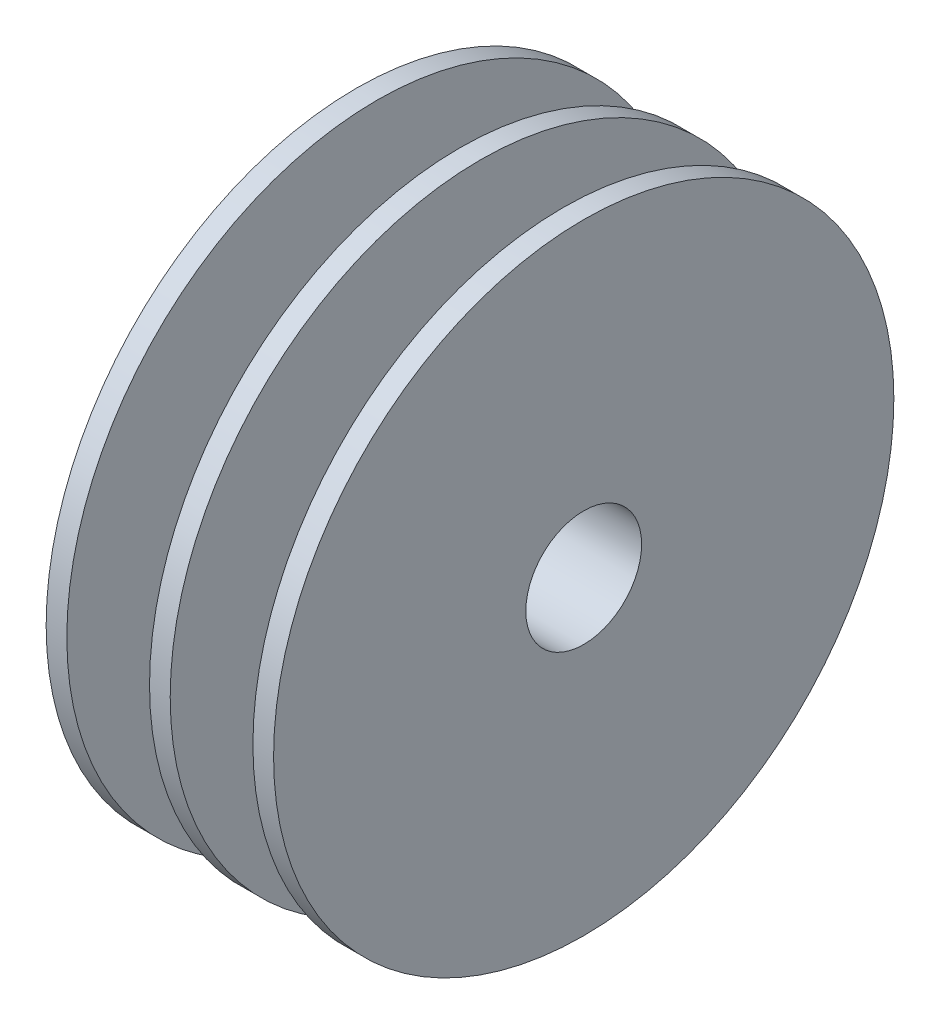
ISO-10303-21;
HEADER;
FILE_DESCRIPTION(('STEP AP214'),'2;1');
FILE_NAME('part.step','',(''),(''),'','','');
FILE_SCHEMA(('AUTOMOTIVE_DESIGN { 1 0 10303 214 1 1 1 1 }'));
ENDSEC;
DATA;
#1=APPLICATION_CONTEXT('core data for automotive mechanical design processes');
#2=APPLICATION_PROTOCOL_DEFINITION('international standard','automotive_design',2000,#1);
#3=PRODUCT_CONTEXT('',#1,'mechanical');
#4=PRODUCT('Part','Part','',(#3));
#5=PRODUCT_RELATED_PRODUCT_CATEGORY('part','',(#4));
#6=PRODUCT_DEFINITION_FORMATION('','',#4);
#7=PRODUCT_DEFINITION_CONTEXT('part definition',#1,'design');
#8=PRODUCT_DEFINITION('design','',#6,#7);
#9=PRODUCT_DEFINITION_SHAPE('','',#8);
#10=(LENGTH_UNIT() NAMED_UNIT(*) SI_UNIT(.MILLI.,.METRE.));
#11=(NAMED_UNIT(*) PLANE_ANGLE_UNIT() SI_UNIT($,.RADIAN.));
#12=(NAMED_UNIT(*) SI_UNIT($,.STERADIAN.) SOLID_ANGLE_UNIT());
#13=UNCERTAINTY_MEASURE_WITH_UNIT(LENGTH_MEASURE(1.E-05),#10,'distance_accuracy_value','');
#14=(GEOMETRIC_REPRESENTATION_CONTEXT(3) GLOBAL_UNCERTAINTY_ASSIGNED_CONTEXT((#13)) GLOBAL_UNIT_ASSIGNED_CONTEXT((#10,
#11,#12)) REPRESENTATION_CONTEXT('',''));
#15=CARTESIAN_POINT('',(0.,0.,0.));
#16=DIRECTION('',(0.,0.,1.));
#17=DIRECTION('',(1.,0.,0.));
#18=AXIS2_PLACEMENT_3D('',#15,#16,#17);
#19=CARTESIAN_POINT('',(1.,0.,0.));
#20=DIRECTION('',(-1.,0.,0.));
#21=DIRECTION('',(0.,0.,1.));
#22=AXIS2_PLACEMENT_3D('',#19,#20,#21);
#23=CYLINDRICAL_SURFACE('',#22,15.);
#24=CARTESIAN_POINT('',(1.,0.,0.));
#25=DIRECTION('',(1.,0.,0.));
#26=DIRECTION('',(0.,0.,-1.));
#27=AXIS2_PLACEMENT_3D('',#24,#25,#26);
#28=CIRCLE('',#27,15.);
#29=CARTESIAN_POINT('',(0.999999999999999,0.,-15.));
#30=VERTEX_POINT('',#29);
#31=EDGE_CURVE('E42',#30,#30,#28,.T.);
#32=ORIENTED_EDGE('',*,*,#31,.F.);
#33=EDGE_LOOP('',(#32));
#34=FACE_BOUND('',#33,.T.);
#35=CARTESIAN_POINT('',(0.,0.,0.));
#36=DIRECTION('',(1.,0.,0.));
#37=DIRECTION('',(0.,0.,-1.));
#38=AXIS2_PLACEMENT_3D('',#35,#36,#37);
#39=CIRCLE('',#38,15.);
#40=CARTESIAN_POINT('',(0.,0.,-15.));
#41=VERTEX_POINT('',#40);
#42=EDGE_CURVE('E56',#41,#41,#39,.T.);
#43=ORIENTED_EDGE('',*,*,#42,.T.);
#44=EDGE_LOOP('',(#43));
#45=FACE_BOUND('',#44,.T.);
#46=ADVANCED_FACE('F30',(#34,#45),#23,.T.);
#47=CARTESIAN_POINT('',(1.,0.,0.));
#48=DIRECTION('',(1.,0.,0.));
#49=DIRECTION('',(0.,0.,-1.));
#50=AXIS2_PLACEMENT_3D('',#47,#48,#49);
#51=PLANE('',#50);
#52=CARTESIAN_POINT('',(1.,0.,0.));
#53=DIRECTION('',(1.,0.,0.));
#54=DIRECTION('',(0.,0.,-1.));
#55=AXIS2_PLACEMENT_3D('',#52,#53,#54);
#56=CIRCLE('',#55,5.);
#57=CARTESIAN_POINT('',(1.,0.,-5.));
#58=VERTEX_POINT('',#57);
#59=EDGE_CURVE('E37',#58,#58,#56,.T.);
#60=ORIENTED_EDGE('',*,*,#59,.F.);
#61=EDGE_LOOP('',(#60));
#62=FACE_BOUND('',#61,.T.);
#63=ORIENTED_EDGE('',*,*,#31,.T.);
#64=EDGE_LOOP('',(#63));
#65=FACE_BOUND('',#64,.T.);
#66=ADVANCED_FACE('F66',(#62,#65),#51,.T.);
#67=CARTESIAN_POINT('',(0.,0.,0.));
#68=DIRECTION('',(1.,0.,0.));
#69=DIRECTION('',(0.,0.,-1.));
#70=AXIS2_PLACEMENT_3D('',#67,#68,#69);
#71=PLANE('',#70);
#72=CARTESIAN_POINT('',(0.,0.,0.));
#73=DIRECTION('',(-1.,0.,0.));
#74=DIRECTION('',(0.,0.,1.));
#75=AXIS2_PLACEMENT_3D('',#72,#73,#74);
#76=CIRCLE('',#75,2.375);
#77=CARTESIAN_POINT('',(0.,0.,2.375));
#78=VERTEX_POINT('',#77);
#79=EDGE_CURVE('E235',#78,#78,#76,.T.);
#80=ORIENTED_EDGE('',*,*,#79,.F.);
#81=EDGE_LOOP('',(#80));
#82=FACE_BOUND('',#81,.T.);
#83=ORIENTED_EDGE('',*,*,#42,.F.);
#84=EDGE_LOOP('',(#83));
#85=FACE_BOUND('',#84,.T.);
#86=ADVANCED_FACE('F63',(#82,#85),#71,.F.);
#87=CARTESIAN_POINT('',(5.,0.,0.));
#88=DIRECTION('',(-1.,0.,0.));
#89=DIRECTION('',(0.,0.,1.));
#90=AXIS2_PLACEMENT_3D('',#87,#88,#89);
#91=CYLINDRICAL_SURFACE('',#90,5.);
#92=CARTESIAN_POINT('',(5.,0.,0.));
#93=DIRECTION('',(1.,0.,0.));
#94=DIRECTION('',(0.,0.,-1.));
#95=AXIS2_PLACEMENT_3D('',#92,#93,#94);
#96=CIRCLE('',#95,5.);
#97=CARTESIAN_POINT('',(5.,0.,-5.));
#98=VERTEX_POINT('',#97);
#99=EDGE_CURVE('E51',#98,#98,#96,.T.);
#100=ORIENTED_EDGE('',*,*,#99,.F.);
#101=EDGE_LOOP('',(#100));
#102=FACE_BOUND('',#101,.T.);
#103=ORIENTED_EDGE('',*,*,#59,.T.);
#104=EDGE_LOOP('',(#103));
#105=FACE_BOUND('',#104,.T.);
#106=ADVANCED_FACE('F65',(#102,#105),#91,.T.);
#107=CARTESIAN_POINT('',(6.,0.,0.));
#108=DIRECTION('',(-1.,0.,0.));
#109=DIRECTION('',(0.,0.,1.));
#110=AXIS2_PLACEMENT_3D('',#107,#108,#109);
#111=CYLINDRICAL_SURFACE('',#110,15.);
#112=CARTESIAN_POINT('',(6.,0.,0.));
#113=DIRECTION('',(1.,0.,0.));
#114=DIRECTION('',(0.,0.,-1.));
#115=AXIS2_PLACEMENT_3D('',#112,#113,#114);
#116=CIRCLE('',#115,15.);
#117=CARTESIAN_POINT('',(6.,0.,-15.));
#118=VERTEX_POINT('',#117);
#119=EDGE_CURVE('E48',#118,#118,#116,.T.);
#120=ORIENTED_EDGE('',*,*,#119,.F.);
#121=EDGE_LOOP('',(#120));
#122=FACE_BOUND('',#121,.T.);
#123=CARTESIAN_POINT('',(5.,0.,0.));
#124=DIRECTION('',(1.,0.,0.));
#125=DIRECTION('',(0.,0.,-1.));
#126=AXIS2_PLACEMENT_3D('',#123,#124,#125);
#127=CIRCLE('',#126,15.);
#128=CARTESIAN_POINT('',(5.,0.,-15.));
#129=VERTEX_POINT('',#128);
#130=EDGE_CURVE('E52',#129,#129,#127,.T.);
#131=ORIENTED_EDGE('',*,*,#130,.T.);
#132=EDGE_LOOP('',(#131));
#133=FACE_BOUND('',#132,.T.);
#134=ADVANCED_FACE('F72',(#122,#133),#111,.T.);
#135=CARTESIAN_POINT('',(6.,0.,0.));
#136=DIRECTION('',(1.,0.,0.));
#137=DIRECTION('',(0.,0.,-1.));
#138=AXIS2_PLACEMENT_3D('',#135,#136,#137);
#139=PLANE('',#138);
#140=CARTESIAN_POINT('',(6.,0.,0.));
#141=DIRECTION('',(1.,0.,0.));
#142=DIRECTION('',(0.,0.,-1.));
#143=AXIS2_PLACEMENT_3D('',#140,#141,#142);
#144=CIRCLE('',#143,5.);
#145=CARTESIAN_POINT('',(6.,0.,-5.));
#146=VERTEX_POINT('',#145);
#147=EDGE_CURVE('E10',#146,#146,#144,.T.);
#148=ORIENTED_EDGE('',*,*,#147,.F.);
#149=EDGE_LOOP('',(#148));
#150=FACE_BOUND('',#149,.T.);
#151=ORIENTED_EDGE('',*,*,#119,.T.);
#152=EDGE_LOOP('',(#151));
#153=FACE_BOUND('',#152,.T.);
#154=ADVANCED_FACE('F104',(#150,#153),#139,.T.);
#155=CARTESIAN_POINT('',(5.,0.,0.));
#156=DIRECTION('',(1.,0.,0.));
#157=DIRECTION('',(0.,0.,-1.));
#158=AXIS2_PLACEMENT_3D('',#155,#156,#157);
#159=PLANE('',#158);
#160=ORIENTED_EDGE('',*,*,#99,.T.);
#161=EDGE_LOOP('',(#160));
#162=FACE_BOUND('',#161,.T.);
#163=ORIENTED_EDGE('',*,*,#130,.F.);
#164=EDGE_LOOP('',(#163));
#165=FACE_BOUND('',#164,.T.);
#166=ADVANCED_FACE('F112',(#162,#165),#159,.F.);
#167=CARTESIAN_POINT('',(10.,0.,0.));
#168=DIRECTION('',(-1.,0.,0.));
#169=DIRECTION('',(0.,0.,1.));
#170=AXIS2_PLACEMENT_3D('',#167,#168,#169);
#171=CYLINDRICAL_SURFACE('',#170,5.);
#172=CARTESIAN_POINT('',(10.,0.,0.));
#173=DIRECTION('',(1.,0.,0.));
#174=DIRECTION('',(0.,0.,-1.));
#175=AXIS2_PLACEMENT_3D('',#172,#173,#174);
#176=CIRCLE('',#175,5.);
#177=CARTESIAN_POINT('',(10.,0.,-5.));
#178=VERTEX_POINT('',#177);
#179=EDGE_CURVE('E46',#178,#178,#176,.T.);
#180=ORIENTED_EDGE('',*,*,#179,.F.);
#181=EDGE_LOOP('',(#180));
#182=FACE_BOUND('',#181,.T.);
#183=ORIENTED_EDGE('',*,*,#147,.T.);
#184=EDGE_LOOP('',(#183));
#185=FACE_BOUND('',#184,.T.);
#186=ADVANCED_FACE('F117',(#182,#185),#171,.T.);
#187=CARTESIAN_POINT('',(11.,0.,0.));
#188=DIRECTION('',(-1.,0.,0.));
#189=DIRECTION('',(0.,0.,1.));
#190=AXIS2_PLACEMENT_3D('',#187,#188,#189);
#191=CYLINDRICAL_SURFACE('',#190,15.);
#192=CARTESIAN_POINT('',(11.,0.,0.));
#193=DIRECTION('',(1.,0.,0.));
#194=DIRECTION('',(0.,0.,-1.));
#195=AXIS2_PLACEMENT_3D('',#192,#193,#194);
#196=CIRCLE('',#195,15.);
#197=CARTESIAN_POINT('',(11.,0.,-15.));
#198=VERTEX_POINT('',#197);
#199=EDGE_CURVE('E242',#198,#198,#196,.T.);
#200=ORIENTED_EDGE('',*,*,#199,.F.);
#201=EDGE_LOOP('',(#200));
#202=FACE_BOUND('',#201,.T.);
#203=CARTESIAN_POINT('',(10.,0.,0.));
#204=DIRECTION('',(1.,0.,0.));
#205=DIRECTION('',(0.,0.,-1.));
#206=AXIS2_PLACEMENT_3D('',#203,#204,#205);
#207=CIRCLE('',#206,15.);
#208=CARTESIAN_POINT('',(10.,0.,-15.));
#209=VERTEX_POINT('',#208);
#210=EDGE_CURVE('E239',#209,#209,#207,.T.);
#211=ORIENTED_EDGE('',*,*,#210,.T.);
#212=EDGE_LOOP('',(#211));
#213=FACE_BOUND('',#212,.T.);
#214=ADVANCED_FACE('F134',(#202,#213),#191,.T.);
#215=CARTESIAN_POINT('',(11.,0.,0.));
#216=DIRECTION('',(1.,0.,0.));
#217=DIRECTION('',(0.,0.,-1.));
#218=AXIS2_PLACEMENT_3D('',#215,#216,#217);
#219=PLANE('',#218);
#220=CARTESIAN_POINT('',(11.,0.,0.));
#221=DIRECTION('',(1.,0.,0.));
#222=DIRECTION('',(0.,0.,-1.));
#223=AXIS2_PLACEMENT_3D('',#220,#221,#222);
#224=CIRCLE('',#223,2.8);
#225=CARTESIAN_POINT('',(11.,0.,-2.8));
#226=VERTEX_POINT('',#225);
#227=EDGE_CURVE('E232',#226,#226,#224,.F.);
#228=ORIENTED_EDGE('',*,*,#227,.T.);
#229=EDGE_LOOP('',(#228));
#230=FACE_BOUND('',#229,.T.);
#231=ORIENTED_EDGE('',*,*,#199,.T.);
#232=EDGE_LOOP('',(#231));
#233=FACE_BOUND('',#232,.T.);
#234=ADVANCED_FACE('F144',(#230,#233),#219,.T.);
#235=CARTESIAN_POINT('',(10.,0.,0.));
#236=DIRECTION('',(1.,0.,0.));
#237=DIRECTION('',(0.,0.,-1.));
#238=AXIS2_PLACEMENT_3D('',#235,#236,#237);
#239=PLANE('',#238);
#240=ORIENTED_EDGE('',*,*,#179,.T.);
#241=EDGE_LOOP('',(#240));
#242=FACE_BOUND('',#241,.T.);
#243=ORIENTED_EDGE('',*,*,#210,.F.);
#244=EDGE_LOOP('',(#243));
#245=FACE_BOUND('',#244,.T.);
#246=ADVANCED_FACE('F152',(#242,#245),#239,.F.);
#247=CARTESIAN_POINT('',(2.,0.,0.));
#248=DIRECTION('',(-1.,0.,0.));
#249=DIRECTION('',(0.,0.,1.));
#250=AXIS2_PLACEMENT_3D('',#247,#248,#249);
#251=CYLINDRICAL_SURFACE('',#250,2.375);
#252=CARTESIAN_POINT('',(2.,0.,0.));
#253=DIRECTION('',(-1.,0.,0.));
#254=DIRECTION('',(0.,0.,1.));
#255=AXIS2_PLACEMENT_3D('',#252,#253,#254);
#256=CIRCLE('',#255,2.375);
#257=CARTESIAN_POINT('',(2.,0.,2.375));
#258=VERTEX_POINT('',#257);
#259=EDGE_CURVE('E236',#258,#258,#256,.T.);
#260=ORIENTED_EDGE('',*,*,#259,.F.);
#261=EDGE_LOOP('',(#260));
#262=FACE_BOUND('',#261,.T.);
#263=ORIENTED_EDGE('',*,*,#79,.T.);
#264=EDGE_LOOP('',(#263));
#265=FACE_BOUND('',#264,.T.);
#266=ADVANCED_FACE('F156',(#262,#265),#251,.F.);
#267=CARTESIAN_POINT('',(2.,0.,0.));
#268=DIRECTION('',(-1.,0.,0.));
#269=DIRECTION('',(0.,0.,1.));
#270=AXIS2_PLACEMENT_3D('',#267,#268,#269);
#271=PLANE('',#270);
#272=CARTESIAN_POINT('',(2.,0.,0.));
#273=DIRECTION('',(-1.,0.,0.));
#274=DIRECTION('',(0.,0.,1.));
#275=AXIS2_PLACEMENT_3D('',#272,#273,#274);
#276=CIRCLE('',#275,0.6);
#277=CARTESIAN_POINT('',(2.,0.,0.6));
#278=VERTEX_POINT('',#277);
#279=EDGE_CURVE('E33',#278,#278,#276,.T.);
#280=ORIENTED_EDGE('',*,*,#279,.F.);
#281=EDGE_LOOP('',(#280));
#282=FACE_BOUND('',#281,.T.);
#283=ORIENTED_EDGE('',*,*,#259,.T.);
#284=EDGE_LOOP('',(#283));
#285=FACE_BOUND('',#284,.T.);
#286=ADVANCED_FACE('F170',(#282,#285),#271,.T.);
#287=CARTESIAN_POINT('',(3.,0.,0.));
#288=DIRECTION('',(-1.,0.,0.));
#289=DIRECTION('',(0.,0.,1.));
#290=AXIS2_PLACEMENT_3D('',#287,#288,#289);
#291=PLANE('',#290);
#292=CARTESIAN_POINT('',(3.,0.,0.));
#293=DIRECTION('',(-1.,0.,0.));
#294=DIRECTION('',(0.,0.,1.));
#295=AXIS2_PLACEMENT_3D('',#292,#293,#294);
#296=CIRCLE('',#295,0.6);
#297=CARTESIAN_POINT('',(3.,0.,0.6));
#298=VERTEX_POINT('',#297);
#299=EDGE_CURVE('E226',#298,#298,#296,.F.);
#300=ORIENTED_EDGE('',*,*,#299,.F.);
#301=EDGE_LOOP('',(#300));
#302=FACE_BOUND('',#301,.T.);
#303=CARTESIAN_POINT('',(3.,0.,0.));
#304=DIRECTION('',(-1.,0.,0.));
#305=DIRECTION('',(0.,0.,1.));
#306=AXIS2_PLACEMENT_3D('',#303,#304,#305);
#307=CIRCLE('',#306,2.8);
#308=CARTESIAN_POINT('',(3.,0.,2.8));
#309=VERTEX_POINT('',#308);
#310=EDGE_CURVE('E228',#309,#309,#307,.T.);
#311=ORIENTED_EDGE('',*,*,#310,.F.);
#312=EDGE_LOOP('',(#311));
#313=FACE_BOUND('',#312,.T.);
#314=ADVANCED_FACE('F191',(#302,#313),#291,.F.);
#315=CARTESIAN_POINT('',(18.9195959492893,0.,0.));
#316=DIRECTION('',(-1.,0.,0.));
#317=DIRECTION('',(0.,0.,1.));
#318=AXIS2_PLACEMENT_3D('',#315,#316,#317);
#319=CYLINDRICAL_SURFACE('',#318,2.8);
#320=ORIENTED_EDGE('',*,*,#310,.T.);
#321=EDGE_LOOP('',(#320));
#322=FACE_BOUND('',#321,.T.);
#323=ORIENTED_EDGE('',*,*,#227,.F.);
#324=EDGE_LOOP('',(#323));
#325=FACE_BOUND('',#324,.T.);
#326=ADVANCED_FACE('F185',(#322,#325),#319,.F.);
#327=CARTESIAN_POINT('',(4.69705627484771,0.,0.));
#328=DIRECTION('',(-1.,0.,0.));
#329=DIRECTION('',(0.,0.,1.));
#330=AXIS2_PLACEMENT_3D('',#327,#328,#329);
#331=CYLINDRICAL_SURFACE('',#330,0.6);
#332=ORIENTED_EDGE('',*,*,#279,.T.);
#333=EDGE_LOOP('',(#332));
#334=FACE_BOUND('',#333,.T.);
#335=ORIENTED_EDGE('',*,*,#299,.T.);
#336=EDGE_LOOP('',(#335));
#337=FACE_BOUND('',#336,.T.);
#338=ADVANCED_FACE('F190',(#334,#337),#331,.F.);
#339=CLOSED_SHELL('',(#46,#66,#86,#106,#134,#154,#166,#186,#214,#234,#246,#266,#286,#314,#326,#338));
#340=MANIFOLD_SOLID_BREP('B2',#339);
#341=ADVANCED_BREP_SHAPE_REPRESENTATION('',(#18,#340),#14);
#342=SHAPE_DEFINITION_REPRESENTATION(#9,#341);
ENDSEC;
END-ISO-10303-21;
